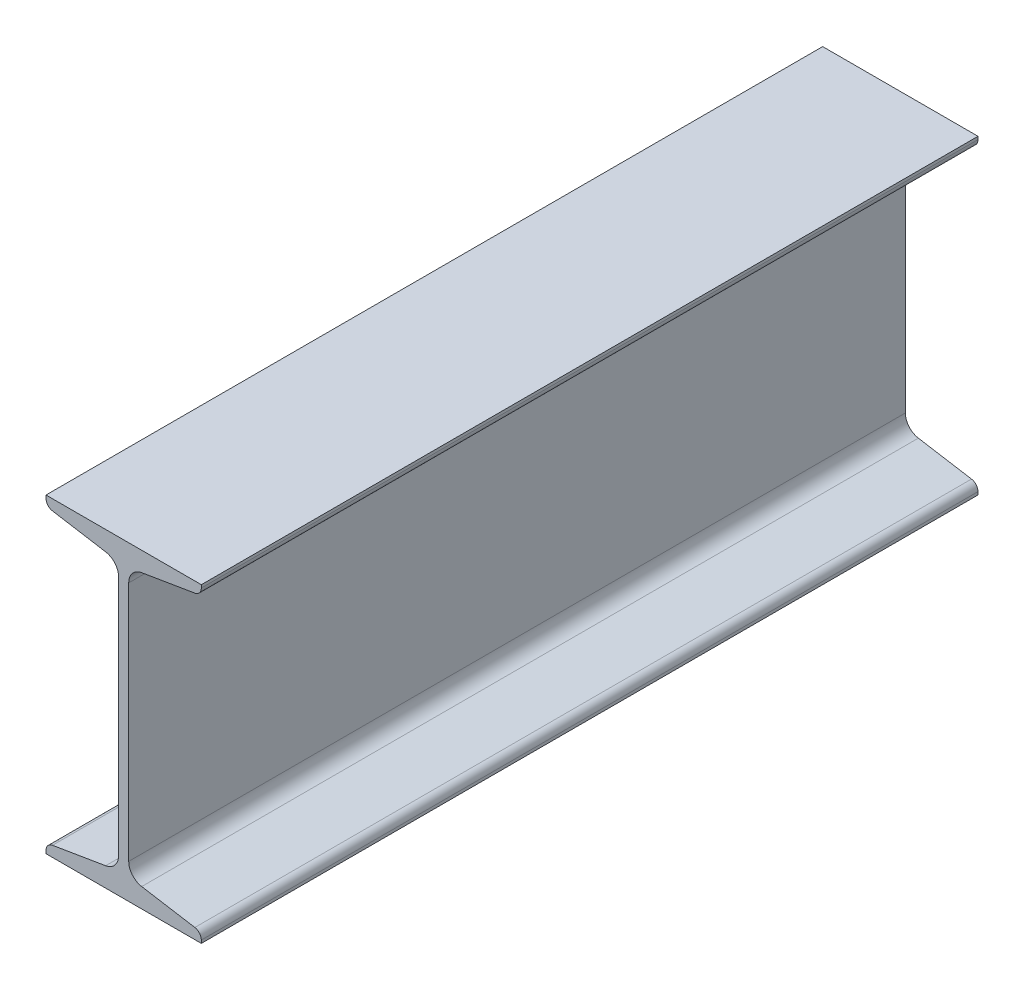
ISO-10303-21;
HEADER;
FILE_DESCRIPTION(('STEP AP214'),'2;1');
FILE_NAME('part.step','',(''),(''),'','','');
FILE_SCHEMA(('AUTOMOTIVE_DESIGN { 1 0 10303 214 1 1 1 1 }'));
ENDSEC;
DATA;
#1=APPLICATION_CONTEXT('core data for automotive mechanical design processes');
#2=APPLICATION_PROTOCOL_DEFINITION('international standard','automotive_design',2000,#1);
#3=PRODUCT_CONTEXT('',#1,'mechanical');
#4=PRODUCT('Part','Part','',(#3));
#5=PRODUCT_RELATED_PRODUCT_CATEGORY('part','',(#4));
#6=PRODUCT_DEFINITION_FORMATION('','',#4);
#7=PRODUCT_DEFINITION_CONTEXT('part definition',#1,'design');
#8=PRODUCT_DEFINITION('design','',#6,#7);
#9=PRODUCT_DEFINITION_SHAPE('','',#8);
#10=(LENGTH_UNIT() NAMED_UNIT(*) SI_UNIT(.MILLI.,.METRE.));
#11=(NAMED_UNIT(*) PLANE_ANGLE_UNIT() SI_UNIT($,.RADIAN.));
#12=(NAMED_UNIT(*) SI_UNIT($,.STERADIAN.) SOLID_ANGLE_UNIT());
#13=UNCERTAINTY_MEASURE_WITH_UNIT(LENGTH_MEASURE(1.E-05),#10,'distance_accuracy_value','');
#14=(GEOMETRIC_REPRESENTATION_CONTEXT(3) GLOBAL_UNCERTAINTY_ASSIGNED_CONTEXT((#13)) GLOBAL_UNIT_ASSIGNED_CONTEXT((#10,
#11,#12)) REPRESENTATION_CONTEXT('',''));
#15=CARTESIAN_POINT('',(0.,0.,0.));
#16=DIRECTION('',(0.,0.,1.));
#17=DIRECTION('',(1.,0.,0.));
#18=AXIS2_PLACEMENT_3D('',#15,#16,#17);
#19=CARTESIAN_POINT('',(120.,-4.44339418899995E-13,300.));
#20=DIRECTION('',(0.,-1.,0.));
#21=DIRECTION('',(1.,0.,0.));
#22=AXIS2_PLACEMENT_3D('',#19,#20,#21);
#23=PLANE('',#22);
#24=DIRECTION('',(-1.,0.,0.));
#25=VECTOR('',#24,1.);
#26=CARTESIAN_POINT('',(120.,-4.44339418899995E-13,-300.));
#27=LINE('',#26,#25);
#28=CARTESIAN_POINT('',(120.,-4.44339418899995E-13,-300.));
#29=VERTEX_POINT('',#28);
#30=CARTESIAN_POINT('',(0.,0.,-300.));
#31=VERTEX_POINT('',#30);
#32=EDGE_CURVE('E233',#29,#31,#27,.T.);
#33=ORIENTED_EDGE('',*,*,#32,.F.);
#34=DIRECTION('',(0.,0.,-1.));
#35=VECTOR('',#34,1.);
#36=CARTESIAN_POINT('',(120.,-4.44339418899995E-13,300.));
#37=LINE('',#36,#35);
#38=CARTESIAN_POINT('',(120.,-4.44339418899995E-13,300.));
#39=VERTEX_POINT('',#38);
#40=EDGE_CURVE('E191',#39,#29,#37,.T.);
#41=ORIENTED_EDGE('',*,*,#40,.F.);
#42=DIRECTION('',(-1.,0.,0.));
#43=VECTOR('',#42,1.);
#44=CARTESIAN_POINT('',(120.,-4.44339418899995E-13,300.));
#45=LINE('',#44,#43);
#46=CARTESIAN_POINT('',(0.,0.,300.));
#47=VERTEX_POINT('',#46);
#48=EDGE_CURVE('E186',#39,#47,#45,.T.);
#49=ORIENTED_EDGE('',*,*,#48,.T.);
#50=DIRECTION('',(0.,0.,-1.));
#51=VECTOR('',#50,1.);
#52=CARTESIAN_POINT('',(0.,0.,300.));
#53=LINE('',#52,#51);
#54=EDGE_CURVE('E169',#47,#31,#53,.T.);
#55=ORIENTED_EDGE('',*,*,#54,.T.);
#56=EDGE_LOOP('',(#33,#41,#49,#55));
#57=FACE_BOUND('',#56,.T.);
#58=ADVANCED_FACE('F32',(#57),#23,.T.);
#59=CARTESIAN_POINT('',(120.,7.32465895539263,300.));
#60=DIRECTION('',(1.,0.,0.));
#61=DIRECTION('',(0.,0.,-1.));
#62=AXIS2_PLACEMENT_3D('',#59,#60,#61);
#63=PLANE('',#62);
#64=DIRECTION('',(0.,-1.,0.));
#65=VECTOR('',#64,1.);
#66=CARTESIAN_POINT('',(120.,7.32465895539263,-300.));
#67=LINE('',#66,#65);
#68=CARTESIAN_POINT('',(120.,2.24195738173786,-300.));
#69=VERTEX_POINT('',#68);
#70=EDGE_CURVE('E192',#69,#29,#67,.T.);
#71=ORIENTED_EDGE('',*,*,#70,.F.);
#72=DIRECTION('',(0.,0.,-1.));
#73=VECTOR('',#72,1.);
#74=CARTESIAN_POINT('',(120.,2.24195738173786,300.));
#75=LINE('',#74,#73);
#76=CARTESIAN_POINT('',(120.,2.24195738173786,300.));
#77=VERTEX_POINT('',#76);
#78=EDGE_CURVE('E305',#69,#77,#75,.F.);
#79=ORIENTED_EDGE('',*,*,#78,.T.);
#80=DIRECTION('',(0.,-1.,0.));
#81=VECTOR('',#80,1.);
#82=CARTESIAN_POINT('',(120.,7.32465895539263,300.));
#83=LINE('',#82,#81);
#84=EDGE_CURVE('E181',#77,#39,#83,.T.);
#85=ORIENTED_EDGE('',*,*,#84,.T.);
#86=ORIENTED_EDGE('',*,*,#40,.T.);
#87=EDGE_LOOP('',(#71,#79,#85,#86));
#88=FACE_BOUND('',#87,.T.);
#89=ADVANCED_FACE('F382',(#88),#63,.T.);
#90=CARTESIAN_POINT('',(73.9270721275245,15.0040404372586,300.));
#91=DIRECTION('',(0.164410656039623,0.986391978972163,0.));
#92=DIRECTION('',(-0.986391978972163,0.164410656039623,0.));
#93=AXIS2_PLACEMENT_3D('',#90,#91,#92);
#94=PLANE('',#93);
#95=DIRECTION('',(0.986391978972163,-0.164410656039623,0.));
#96=VECTOR('',#95,1.);
#97=CARTESIAN_POINT('',(73.9270721275245,15.0040404372586,300.));
#98=LINE('',#97,#96);
#99=CARTESIAN_POINT('',(73.9270721275245,15.0040404372586,300.));
#100=VERTEX_POINT('',#99);
#101=CARTESIAN_POINT('',(114.986463936238,8.16030925557084,300.));
#102=VERTEX_POINT('',#101);
#103=EDGE_CURVE('E229',#100,#102,#98,.T.);
#104=ORIENTED_EDGE('',*,*,#103,.T.);
#105=DIRECTION('',(0.,0.,-1.));
#106=VECTOR('',#105,1.);
#107=CARTESIAN_POINT('',(114.986463936238,8.16030925557084,300.));
#108=LINE('',#107,#106);
#109=CARTESIAN_POINT('',(114.986463936238,8.16030925557084,-300.));
#110=VERTEX_POINT('',#109);
#111=EDGE_CURVE('E272',#102,#110,#108,.T.);
#112=ORIENTED_EDGE('',*,*,#111,.T.);
#113=DIRECTION('',(0.986391978972163,-0.164410656039623,0.));
#114=VECTOR('',#113,1.);
#115=CARTESIAN_POINT('',(73.9270721275245,15.0040404372586,-300.));
#116=LINE('',#115,#114);
#117=CARTESIAN_POINT('',(73.9270721275245,15.0040404372586,-300.));
#118=VERTEX_POINT('',#117);
#119=EDGE_CURVE('E194',#118,#110,#116,.T.);
#120=ORIENTED_EDGE('',*,*,#119,.F.);
#121=DIRECTION('',(0.,0.,-1.));
#122=VECTOR('',#121,1.);
#123=CARTESIAN_POINT('',(73.9270721275245,15.0040404372586,300.));
#124=LINE('',#123,#122);
#125=EDGE_CURVE('E273',#100,#118,#124,.T.);
#126=ORIENTED_EDGE('',*,*,#125,.F.);
#127=EDGE_LOOP('',(#104,#112,#120,#126));
#128=FACE_BOUND('',#127,.T.);
#129=ADVANCED_FACE('F376',(#128),#94,.T.);
#130=CARTESIAN_POINT('',(75.9,26.8407441849245,300.));
#131=DIRECTION('',(0.,0.,-1.));
#132=DIRECTION('',(-1.,0.,0.));
#133=AXIS2_PLACEMENT_3D('',#130,#131,#132);
#134=CYLINDRICAL_SURFACE('',#133,12.);
#135=CARTESIAN_POINT('',(75.9,26.8407441849245,-300.));
#136=DIRECTION('',(0.,0.,1.));
#137=DIRECTION('',(1.,0.,0.));
#138=AXIS2_PLACEMENT_3D('',#135,#136,#137);
#139=CIRCLE('',#138,12.);
#140=CARTESIAN_POINT('',(63.9,26.8407441849245,-300.));
#141=VERTEX_POINT('',#140);
#142=EDGE_CURVE('E266',#141,#118,#139,.T.);
#143=ORIENTED_EDGE('',*,*,#142,.F.);
#144=DIRECTION('',(0.,0.,-1.));
#145=VECTOR('',#144,1.);
#146=CARTESIAN_POINT('',(63.9,26.8407441849245,300.));
#147=LINE('',#146,#145);
#148=CARTESIAN_POINT('',(63.9,26.8407441849245,300.));
#149=VERTEX_POINT('',#148);
#150=EDGE_CURVE('E275',#149,#141,#147,.T.);
#151=ORIENTED_EDGE('',*,*,#150,.F.);
#152=CARTESIAN_POINT('',(75.9,26.8407441849245,300.));
#153=DIRECTION('',(0.,0.,1.));
#154=DIRECTION('',(1.,0.,0.));
#155=AXIS2_PLACEMENT_3D('',#152,#153,#154);
#156=CIRCLE('',#155,12.);
#157=EDGE_CURVE('E226',#149,#100,#156,.T.);
#158=ORIENTED_EDGE('',*,*,#157,.T.);
#159=ORIENTED_EDGE('',*,*,#125,.T.);
#160=EDGE_LOOP('',(#143,#151,#158,#159));
#161=FACE_BOUND('',#160,.T.);
#162=ADVANCED_FACE('F372',(#161),#134,.F.);
#163=CARTESIAN_POINT('',(63.9,213.159255815075,300.));
#164=DIRECTION('',(1.,0.,0.));
#165=DIRECTION('',(0.,1.,0.));
#166=AXIS2_PLACEMENT_3D('',#163,#164,#165);
#167=PLANE('',#166);
#168=DIRECTION('',(0.,-1.,0.));
#169=VECTOR('',#168,1.);
#170=CARTESIAN_POINT('',(63.9,213.159255815075,-300.));
#171=LINE('',#170,#169);
#172=CARTESIAN_POINT('',(63.9,213.159255815075,-300.));
#173=VERTEX_POINT('',#172);
#174=EDGE_CURVE('E263',#173,#141,#171,.T.);
#175=ORIENTED_EDGE('',*,*,#174,.F.);
#176=DIRECTION('',(0.,0.,-1.));
#177=VECTOR('',#176,1.);
#178=CARTESIAN_POINT('',(63.9,213.159255815075,300.));
#179=LINE('',#178,#177);
#180=CARTESIAN_POINT('',(63.9,213.159255815075,300.));
#181=VERTEX_POINT('',#180);
#182=EDGE_CURVE('E277',#181,#173,#179,.T.);
#183=ORIENTED_EDGE('',*,*,#182,.F.);
#184=DIRECTION('',(0.,-1.,0.));
#185=VECTOR('',#184,1.);
#186=CARTESIAN_POINT('',(63.9,213.159255815075,300.));
#187=LINE('',#186,#185);
#188=EDGE_CURVE('E223',#181,#149,#187,.T.);
#189=ORIENTED_EDGE('',*,*,#188,.T.);
#190=ORIENTED_EDGE('',*,*,#150,.T.);
#191=EDGE_LOOP('',(#175,#183,#189,#190));
#192=FACE_BOUND('',#191,.T.);
#193=ADVANCED_FACE('F368',(#192),#167,.T.);
#194=CARTESIAN_POINT('',(75.8999999999999,213.159255815075,300.));
#195=DIRECTION('',(0.,0.,-1.));
#196=DIRECTION('',(-1.,0.,0.));
#197=AXIS2_PLACEMENT_3D('',#194,#195,#196);
#198=CYLINDRICAL_SURFACE('',#197,12.);
#199=CARTESIAN_POINT('',(75.8999999999999,213.159255815075,-300.));
#200=DIRECTION('',(0.,0.,1.));
#201=DIRECTION('',(1.,0.,0.));
#202=AXIS2_PLACEMENT_3D('',#199,#200,#201);
#203=CIRCLE('',#202,12.);
#204=CARTESIAN_POINT('',(73.9270721275245,224.995959562741,-300.));
#205=VERTEX_POINT('',#204);
#206=EDGE_CURVE('E260',#205,#173,#203,.T.);
#207=ORIENTED_EDGE('',*,*,#206,.F.);
#208=DIRECTION('',(0.,0.,-1.));
#209=VECTOR('',#208,1.);
#210=CARTESIAN_POINT('',(73.9270721275245,224.995959562741,300.));
#211=LINE('',#210,#209);
#212=CARTESIAN_POINT('',(73.9270721275245,224.995959562741,300.));
#213=VERTEX_POINT('',#212);
#214=EDGE_CURVE('E279',#213,#205,#211,.T.);
#215=ORIENTED_EDGE('',*,*,#214,.F.);
#216=CARTESIAN_POINT('',(75.8999999999999,213.159255815075,300.));
#217=DIRECTION('',(0.,0.,1.));
#218=DIRECTION('',(1.,0.,0.));
#219=AXIS2_PLACEMENT_3D('',#216,#217,#218);
#220=CIRCLE('',#219,12.);
#221=EDGE_CURVE('E220',#213,#181,#220,.T.);
#222=ORIENTED_EDGE('',*,*,#221,.T.);
#223=ORIENTED_EDGE('',*,*,#182,.T.);
#224=EDGE_LOOP('',(#207,#215,#222,#223));
#225=FACE_BOUND('',#224,.T.);
#226=ADVANCED_FACE('F364',(#225),#198,.F.);
#227=CARTESIAN_POINT('',(120.,232.675341044606,300.));
#228=DIRECTION('',(0.164410656039623,-0.986391978972163,0.));
#229=DIRECTION('',(0.986391978972163,0.164410656039623,0.));
#230=AXIS2_PLACEMENT_3D('',#227,#228,#229);
#231=PLANE('',#230);
#232=DIRECTION('',(-0.986391978972164,-0.164410656039623,0.));
#233=VECTOR('',#232,1.);
#234=CARTESIAN_POINT('',(120.,232.675341044606,-300.));
#235=LINE('',#234,#233);
#236=CARTESIAN_POINT('',(114.986463936238,231.839690744428,-300.));
#237=VERTEX_POINT('',#236);
#238=EDGE_CURVE('E258',#237,#205,#235,.T.);
#239=ORIENTED_EDGE('',*,*,#238,.F.);
#240=DIRECTION('',(0.,0.,-1.));
#241=VECTOR('',#240,1.);
#242=CARTESIAN_POINT('',(114.986463936238,231.839690744428,300.));
#243=LINE('',#242,#241);
#244=CARTESIAN_POINT('',(114.986463936238,231.839690744428,300.));
#245=VERTEX_POINT('',#244);
#246=EDGE_CURVE('E320',#237,#245,#243,.F.);
#247=ORIENTED_EDGE('',*,*,#246,.T.);
#248=DIRECTION('',(-0.986391978972164,-0.164410656039623,0.));
#249=VECTOR('',#248,1.);
#250=CARTESIAN_POINT('',(120.,232.675341044606,300.));
#251=LINE('',#250,#249);
#252=EDGE_CURVE('E218',#245,#213,#251,.T.);
#253=ORIENTED_EDGE('',*,*,#252,.T.);
#254=ORIENTED_EDGE('',*,*,#214,.T.);
#255=EDGE_LOOP('',(#239,#247,#253,#254));
#256=FACE_BOUND('',#255,.T.);
#257=ADVANCED_FACE('F358',(#256),#231,.T.);
#258=CARTESIAN_POINT('',(120.,240.,300.));
#259=DIRECTION('',(1.,0.,0.));
#260=DIRECTION('',(0.,1.,0.));
#261=AXIS2_PLACEMENT_3D('',#258,#259,#260);
#262=PLANE('',#261);
#263=DIRECTION('',(0.,-1.,0.));
#264=VECTOR('',#263,1.);
#265=CARTESIAN_POINT('',(120.,240.,300.));
#266=LINE('',#265,#264);
#267=CARTESIAN_POINT('',(120.,240.,300.));
#268=VERTEX_POINT('',#267);
#269=CARTESIAN_POINT('',(120.,237.758042618261,300.));
#270=VERTEX_POINT('',#269);
#271=EDGE_CURVE('E215',#268,#270,#266,.T.);
#272=ORIENTED_EDGE('',*,*,#271,.T.);
#273=DIRECTION('',(0.,0.,-1.));
#274=VECTOR('',#273,1.);
#275=CARTESIAN_POINT('',(120.,237.758042618261,300.));
#276=LINE('',#275,#274);
#277=CARTESIAN_POINT('',(120.,237.758042618261,-300.));
#278=VERTEX_POINT('',#277);
#279=EDGE_CURVE('E317',#270,#278,#276,.T.);
#280=ORIENTED_EDGE('',*,*,#279,.T.);
#281=DIRECTION('',(0.,-1.,0.));
#282=VECTOR('',#281,1.);
#283=CARTESIAN_POINT('',(120.,240.,-300.));
#284=LINE('',#283,#282);
#285=CARTESIAN_POINT('',(120.,240.,-300.));
#286=VERTEX_POINT('',#285);
#287=EDGE_CURVE('E255',#286,#278,#284,.T.);
#288=ORIENTED_EDGE('',*,*,#287,.F.);
#289=DIRECTION('',(0.,0.,-1.));
#290=VECTOR('',#289,1.);
#291=CARTESIAN_POINT('',(120.,240.,300.));
#292=LINE('',#291,#290);
#293=EDGE_CURVE('E282',#268,#286,#292,.T.);
#294=ORIENTED_EDGE('',*,*,#293,.F.);
#295=EDGE_LOOP('',(#272,#280,#288,#294));
#296=FACE_BOUND('',#295,.T.);
#297=ADVANCED_FACE('F350',(#296),#262,.T.);
#298=CARTESIAN_POINT('',(0.,240.,300.));
#299=DIRECTION('',(0.,1.,0.));
#300=DIRECTION('',(0.,0.,1.));
#301=AXIS2_PLACEMENT_3D('',#298,#299,#300);
#302=PLANE('',#301);
#303=DIRECTION('',(1.,0.,0.));
#304=VECTOR('',#303,1.);
#305=CARTESIAN_POINT('',(0.,240.,-300.));
#306=LINE('',#305,#304);
#307=CARTESIAN_POINT('',(0.,240.,-300.));
#308=VERTEX_POINT('',#307);
#309=EDGE_CURVE('E252',#308,#286,#306,.T.);
#310=ORIENTED_EDGE('',*,*,#309,.F.);
#311=DIRECTION('',(0.,0.,-1.));
#312=VECTOR('',#311,1.);
#313=CARTESIAN_POINT('',(0.,240.,300.));
#314=LINE('',#313,#312);
#315=CARTESIAN_POINT('',(0.,240.,300.));
#316=VERTEX_POINT('',#315);
#317=EDGE_CURVE('E284',#316,#308,#314,.T.);
#318=ORIENTED_EDGE('',*,*,#317,.F.);
#319=DIRECTION('',(1.,0.,0.));
#320=VECTOR('',#319,1.);
#321=CARTESIAN_POINT('',(0.,240.,300.));
#322=LINE('',#321,#320);
#323=EDGE_CURVE('E212',#316,#268,#322,.T.);
#324=ORIENTED_EDGE('',*,*,#323,.T.);
#325=ORIENTED_EDGE('',*,*,#293,.T.);
#326=EDGE_LOOP('',(#310,#318,#324,#325));
#327=FACE_BOUND('',#326,.T.);
#328=ADVANCED_FACE('F347',(#327),#302,.T.);
#329=CARTESIAN_POINT('',(0.,232.675341044606,300.));
#330=DIRECTION('',(-1.,0.,0.));
#331=DIRECTION('',(0.,-1.,0.));
#332=AXIS2_PLACEMENT_3D('',#329,#330,#331);
#333=PLANE('',#332);
#334=DIRECTION('',(0.,1.,0.));
#335=VECTOR('',#334,1.);
#336=CARTESIAN_POINT('',(0.,232.675341044606,-300.));
#337=LINE('',#336,#335);
#338=CARTESIAN_POINT('',(0.,237.758042618261,-300.));
#339=VERTEX_POINT('',#338);
#340=EDGE_CURVE('E250',#339,#308,#337,.T.);
#341=ORIENTED_EDGE('',*,*,#340,.F.);
#342=DIRECTION('',(0.,0.,-1.));
#343=VECTOR('',#342,1.);
#344=CARTESIAN_POINT('',(0.,237.758042618261,300.));
#345=LINE('',#344,#343);
#346=CARTESIAN_POINT('',(0.,237.758042618261,300.));
#347=VERTEX_POINT('',#346);
#348=EDGE_CURVE('E11',#339,#347,#345,.F.);
#349=ORIENTED_EDGE('',*,*,#348,.T.);
#350=DIRECTION('',(0.,1.,0.));
#351=VECTOR('',#350,1.);
#352=CARTESIAN_POINT('',(0.,232.675341044606,300.));
#353=LINE('',#352,#351);
#354=EDGE_CURVE('E210',#347,#316,#353,.T.);
#355=ORIENTED_EDGE('',*,*,#354,.T.);
#356=ORIENTED_EDGE('',*,*,#317,.T.);
#357=EDGE_LOOP('',(#341,#349,#355,#356));
#358=FACE_BOUND('',#357,.T.);
#359=ADVANCED_FACE('F342',(#358),#333,.T.);
#360=CARTESIAN_POINT('',(46.0729278724754,224.99595956274,300.));
#361=DIRECTION('',(-0.164410656039624,-0.986391978972163,0.));
#362=DIRECTION('',(0.986391978972163,-0.164410656039624,0.));
#363=AXIS2_PLACEMENT_3D('',#360,#361,#362);
#364=PLANE('',#363);
#365=DIRECTION('',(-0.986391978972163,0.164410656039624,0.));
#366=VECTOR('',#365,1.);
#367=CARTESIAN_POINT('',(46.0729278724754,224.99595956274,300.));
#368=LINE('',#367,#366);
#369=CARTESIAN_POINT('',(46.0729278724754,224.99595956274,300.));
#370=VERTEX_POINT('',#369);
#371=CARTESIAN_POINT('',(5.01353606376221,231.839690744428,300.));
#372=VERTEX_POINT('',#371);
#373=EDGE_CURVE('E207',#370,#372,#368,.T.);
#374=ORIENTED_EDGE('',*,*,#373,.T.);
#375=DIRECTION('',(0.,0.,-1.));
#376=VECTOR('',#375,1.);
#377=CARTESIAN_POINT('',(5.01353606376221,231.839690744428,300.));
#378=LINE('',#377,#376);
#379=CARTESIAN_POINT('',(5.01353606376221,231.839690744428,-300.));
#380=VERTEX_POINT('',#379);
#381=EDGE_CURVE('E40',#372,#380,#378,.T.);
#382=ORIENTED_EDGE('',*,*,#381,.T.);
#383=DIRECTION('',(-0.986391978972163,0.164410656039624,0.));
#384=VECTOR('',#383,1.);
#385=CARTESIAN_POINT('',(46.0729278724754,224.99595956274,-300.));
#386=LINE('',#385,#384);
#387=CARTESIAN_POINT('',(46.0729278724754,224.99595956274,-300.));
#388=VERTEX_POINT('',#387);
#389=EDGE_CURVE('E247',#388,#380,#386,.T.);
#390=ORIENTED_EDGE('',*,*,#389,.F.);
#391=DIRECTION('',(0.,0.,-1.));
#392=VECTOR('',#391,1.);
#393=CARTESIAN_POINT('',(46.0729278724754,224.99595956274,300.));
#394=LINE('',#393,#392);
#395=EDGE_CURVE('E287',#370,#388,#394,.T.);
#396=ORIENTED_EDGE('',*,*,#395,.F.);
#397=EDGE_LOOP('',(#374,#382,#390,#396));
#398=FACE_BOUND('',#397,.T.);
#399=ADVANCED_FACE('F325',(#398),#364,.T.);
#400=CARTESIAN_POINT('',(44.1,213.159255815075,300.));
#401=DIRECTION('',(0.,0.,-1.));
#402=DIRECTION('',(-1.,0.,0.));
#403=AXIS2_PLACEMENT_3D('',#400,#401,#402);
#404=CYLINDRICAL_SURFACE('',#403,12.);
#405=CARTESIAN_POINT('',(44.1,213.159255815075,-300.));
#406=DIRECTION('',(0.,0.,1.));
#407=DIRECTION('',(1.,0.,0.));
#408=AXIS2_PLACEMENT_3D('',#405,#406,#407);
#409=CIRCLE('',#408,12.);
#410=CARTESIAN_POINT('',(56.1,213.159255815074,-300.));
#411=VERTEX_POINT('',#410);
#412=EDGE_CURVE('E244',#411,#388,#409,.T.);
#413=ORIENTED_EDGE('',*,*,#412,.F.);
#414=DIRECTION('',(0.,0.,-1.));
#415=VECTOR('',#414,1.);
#416=CARTESIAN_POINT('',(56.1,213.159255815074,300.));
#417=LINE('',#416,#415);
#418=CARTESIAN_POINT('',(56.1,213.159255815074,300.));
#419=VERTEX_POINT('',#418);
#420=EDGE_CURVE('E289',#419,#411,#417,.T.);
#421=ORIENTED_EDGE('',*,*,#420,.F.);
#422=CARTESIAN_POINT('',(44.1,213.159255815075,300.));
#423=DIRECTION('',(0.,0.,1.));
#424=DIRECTION('',(1.,0.,0.));
#425=AXIS2_PLACEMENT_3D('',#422,#423,#424);
#426=CIRCLE('',#425,12.);
#427=EDGE_CURVE('E204',#419,#370,#426,.T.);
#428=ORIENTED_EDGE('',*,*,#427,.T.);
#429=ORIENTED_EDGE('',*,*,#395,.T.);
#430=EDGE_LOOP('',(#413,#421,#428,#429));
#431=FACE_BOUND('',#430,.T.);
#432=ADVANCED_FACE('F335',(#431),#404,.F.);
#433=CARTESIAN_POINT('',(56.1,26.8407441849245,300.));
#434=DIRECTION('',(-1.,0.,0.));
#435=DIRECTION('',(0.,-1.,0.));
#436=AXIS2_PLACEMENT_3D('',#433,#434,#435);
#437=PLANE('',#436);
#438=DIRECTION('',(0.,1.,0.));
#439=VECTOR('',#438,1.);
#440=CARTESIAN_POINT('',(56.1,26.8407441849245,-300.));
#441=LINE('',#440,#439);
#442=CARTESIAN_POINT('',(56.1,26.8407441849245,-300.));
#443=VERTEX_POINT('',#442);
#444=EDGE_CURVE('E241',#443,#411,#441,.T.);
#445=ORIENTED_EDGE('',*,*,#444,.F.);
#446=DIRECTION('',(0.,0.,-1.));
#447=VECTOR('',#446,1.);
#448=CARTESIAN_POINT('',(56.1,26.8407441849245,300.));
#449=LINE('',#448,#447);
#450=CARTESIAN_POINT('',(56.1,26.8407441849245,300.));
#451=VERTEX_POINT('',#450);
#452=EDGE_CURVE('E291',#451,#443,#449,.T.);
#453=ORIENTED_EDGE('',*,*,#452,.F.);
#454=DIRECTION('',(0.,1.,0.));
#455=VECTOR('',#454,1.);
#456=CARTESIAN_POINT('',(56.1,26.8407441849245,300.));
#457=LINE('',#456,#455);
#458=EDGE_CURVE('E201',#451,#419,#457,.T.);
#459=ORIENTED_EDGE('',*,*,#458,.T.);
#460=ORIENTED_EDGE('',*,*,#420,.T.);
#461=EDGE_LOOP('',(#445,#453,#459,#460));
#462=FACE_BOUND('',#461,.T.);
#463=ADVANCED_FACE('F410',(#462),#437,.T.);
#464=CARTESIAN_POINT('',(44.1,26.8407441849245,300.));
#465=DIRECTION('',(0.,0.,-1.));
#466=DIRECTION('',(-1.,0.,0.));
#467=AXIS2_PLACEMENT_3D('',#464,#465,#466);
#468=CYLINDRICAL_SURFACE('',#467,12.);
#469=CARTESIAN_POINT('',(44.1,26.8407441849245,-300.));
#470=DIRECTION('',(0.,0.,1.));
#471=DIRECTION('',(1.,0.,0.));
#472=AXIS2_PLACEMENT_3D('',#469,#470,#471);
#473=CIRCLE('',#472,12.);
#474=CARTESIAN_POINT('',(46.0729278724755,15.0040404372586,-300.));
#475=VERTEX_POINT('',#474);
#476=EDGE_CURVE('E238',#475,#443,#473,.T.);
#477=ORIENTED_EDGE('',*,*,#476,.F.);
#478=DIRECTION('',(0.,0.,-1.));
#479=VECTOR('',#478,1.);
#480=CARTESIAN_POINT('',(46.0729278724755,15.0040404372586,300.));
#481=LINE('',#480,#479);
#482=CARTESIAN_POINT('',(46.0729278724755,15.0040404372586,300.));
#483=VERTEX_POINT('',#482);
#484=EDGE_CURVE('E180',#483,#475,#481,.T.);
#485=ORIENTED_EDGE('',*,*,#484,.F.);
#486=CARTESIAN_POINT('',(44.1,26.8407441849245,300.));
#487=DIRECTION('',(0.,0.,1.));
#488=DIRECTION('',(1.,0.,0.));
#489=AXIS2_PLACEMENT_3D('',#486,#487,#488);
#490=CIRCLE('',#489,12.);
#491=EDGE_CURVE('E198',#483,#451,#490,.T.);
#492=ORIENTED_EDGE('',*,*,#491,.T.);
#493=ORIENTED_EDGE('',*,*,#452,.T.);
#494=EDGE_LOOP('',(#477,#485,#492,#493));
#495=FACE_BOUND('',#494,.T.);
#496=ADVANCED_FACE('F407',(#495),#468,.F.);
#497=CARTESIAN_POINT('',(0.,7.32465895539261,300.));
#498=DIRECTION('',(-0.164410656039623,0.986391978972163,0.));
#499=DIRECTION('',(-0.986391978972163,-0.164410656039623,0.));
#500=AXIS2_PLACEMENT_3D('',#497,#498,#499);
#501=PLANE('',#500);
#502=DIRECTION('',(0.986391978972163,0.164410656039623,0.));
#503=VECTOR('',#502,1.);
#504=CARTESIAN_POINT('',(0.,7.32465895539261,-300.));
#505=LINE('',#504,#503);
#506=CARTESIAN_POINT('',(5.01353606376226,8.16030925557082,-300.));
#507=VERTEX_POINT('',#506);
#508=EDGE_CURVE('E236',#507,#475,#505,.T.);
#509=ORIENTED_EDGE('',*,*,#508,.F.);
#510=DIRECTION('',(0.,0.,-1.));
#511=VECTOR('',#510,1.);
#512=CARTESIAN_POINT('',(5.01353606376226,8.16030925557082,300.));
#513=LINE('',#512,#511);
#514=CARTESIAN_POINT('',(5.01353606376226,8.16030925557082,300.));
#515=VERTEX_POINT('',#514);
#516=EDGE_CURVE('E55',#507,#515,#513,.F.);
#517=ORIENTED_EDGE('',*,*,#516,.T.);
#518=DIRECTION('',(0.986391978972163,0.164410656039623,0.));
#519=VECTOR('',#518,1.);
#520=CARTESIAN_POINT('',(0.,7.32465895539261,300.));
#521=LINE('',#520,#519);
#522=EDGE_CURVE('E187',#515,#483,#521,.T.);
#523=ORIENTED_EDGE('',*,*,#522,.T.);
#524=ORIENTED_EDGE('',*,*,#484,.T.);
#525=EDGE_LOOP('',(#509,#517,#523,#524));
#526=FACE_BOUND('',#525,.T.);
#527=ADVANCED_FACE('F404',(#526),#501,.T.);
#528=CARTESIAN_POINT('',(0.,0.,300.));
#529=DIRECTION('',(-1.,0.,0.));
#530=DIRECTION('',(0.,-1.,0.));
#531=AXIS2_PLACEMENT_3D('',#528,#529,#530);
#532=PLANE('',#531);
#533=DIRECTION('',(0.,1.,0.));
#534=VECTOR('',#533,1.);
#535=CARTESIAN_POINT('',(0.,0.,300.));
#536=LINE('',#535,#534);
#537=CARTESIAN_POINT('',(0.,2.24195738173783,300.));
#538=VERTEX_POINT('',#537);
#539=EDGE_CURVE('E172',#47,#538,#536,.T.);
#540=ORIENTED_EDGE('',*,*,#539,.T.);
#541=DIRECTION('',(0.,0.,-1.));
#542=VECTOR('',#541,1.);
#543=CARTESIAN_POINT('',(0.,2.24195738173783,300.));
#544=LINE('',#543,#542);
#545=CARTESIAN_POINT('',(0.,2.24195738173783,-300.));
#546=VERTEX_POINT('',#545);
#547=EDGE_CURVE('E314',#538,#546,#544,.T.);
#548=ORIENTED_EDGE('',*,*,#547,.T.);
#549=DIRECTION('',(0.,1.,0.));
#550=VECTOR('',#549,1.);
#551=CARTESIAN_POINT('',(0.,0.,-300.));
#552=LINE('',#551,#550);
#553=EDGE_CURVE('E175',#31,#546,#552,.T.);
#554=ORIENTED_EDGE('',*,*,#553,.F.);
#555=ORIENTED_EDGE('',*,*,#54,.F.);
#556=EDGE_LOOP('',(#540,#548,#554,#555));
#557=FACE_BOUND('',#556,.T.);
#558=ADVANCED_FACE('F170',(#557),#532,.T.);
#559=CARTESIAN_POINT('',(44.1,26.8407441849245,300.));
#560=DIRECTION('',(0.,0.,1.));
#561=DIRECTION('',(1.,0.,0.));
#562=AXIS2_PLACEMENT_3D('',#559,#560,#561);
#563=PLANE('',#562);
#564=ORIENTED_EDGE('',*,*,#84,.F.);
#565=CARTESIAN_POINT('',(114.,2.24195738173786,300.));
#566=DIRECTION('',(0.,0.,1.));
#567=DIRECTION('',(1.,0.,0.));
#568=AXIS2_PLACEMENT_3D('',#565,#566,#567);
#569=CIRCLE('',#568,6.);
#570=EDGE_CURVE('E312',#77,#102,#569,.T.);
#571=ORIENTED_EDGE('',*,*,#570,.T.);
#572=ORIENTED_EDGE('',*,*,#103,.F.);
#573=ORIENTED_EDGE('',*,*,#157,.F.);
#574=ORIENTED_EDGE('',*,*,#188,.F.);
#575=ORIENTED_EDGE('',*,*,#221,.F.);
#576=ORIENTED_EDGE('',*,*,#252,.F.);
#577=CARTESIAN_POINT('',(114.,237.758042618261,300.));
#578=DIRECTION('',(0.,0.,1.));
#579=DIRECTION('',(1.,0.,0.));
#580=AXIS2_PLACEMENT_3D('',#577,#578,#579);
#581=CIRCLE('',#580,6.);
#582=EDGE_CURVE('E309',#245,#270,#581,.T.);
#583=ORIENTED_EDGE('',*,*,#582,.T.);
#584=ORIENTED_EDGE('',*,*,#271,.F.);
#585=ORIENTED_EDGE('',*,*,#323,.F.);
#586=ORIENTED_EDGE('',*,*,#354,.F.);
#587=CARTESIAN_POINT('',(5.99999999999995,237.758042618261,300.));
#588=DIRECTION('',(0.,0.,1.));
#589=DIRECTION('',(1.,0.,0.));
#590=AXIS2_PLACEMENT_3D('',#587,#588,#589);
#591=CIRCLE('',#590,6.);
#592=EDGE_CURVE('E307',#347,#372,#591,.T.);
#593=ORIENTED_EDGE('',*,*,#592,.T.);
#594=ORIENTED_EDGE('',*,*,#373,.F.);
#595=ORIENTED_EDGE('',*,*,#427,.F.);
#596=ORIENTED_EDGE('',*,*,#458,.F.);
#597=ORIENTED_EDGE('',*,*,#491,.F.);
#598=ORIENTED_EDGE('',*,*,#522,.F.);
#599=CARTESIAN_POINT('',(6.,2.24195738173783,300.));
#600=DIRECTION('',(0.,0.,1.));
#601=DIRECTION('',(1.,0.,0.));
#602=AXIS2_PLACEMENT_3D('',#599,#600,#601);
#603=CIRCLE('',#602,6.);
#604=EDGE_CURVE('E47',#515,#538,#603,.T.);
#605=ORIENTED_EDGE('',*,*,#604,.T.);
#606=ORIENTED_EDGE('',*,*,#539,.F.);
#607=ORIENTED_EDGE('',*,*,#48,.F.);
#608=EDGE_LOOP('',(#564,#571,#572,#573,#574,#575,#576,#583,#584,#585,#586,#593,#594,#595,#596,
#597,#598,#605,#606,#607));
#609=FACE_BOUND('',#608,.T.);
#610=ADVANCED_FACE('F185',(#609),#563,.T.);
#611=CARTESIAN_POINT('',(44.1,26.8407441849245,-300.));
#612=DIRECTION('',(0.,0.,1.));
#613=DIRECTION('',(1.,0.,0.));
#614=AXIS2_PLACEMENT_3D('',#611,#612,#613);
#615=PLANE('',#614);
#616=ORIENTED_EDGE('',*,*,#119,.T.);
#617=CARTESIAN_POINT('',(114.,2.24195738173786,-300.));
#618=DIRECTION('',(0.,0.,1.));
#619=DIRECTION('',(1.,0.,0.));
#620=AXIS2_PLACEMENT_3D('',#617,#618,#619);
#621=CIRCLE('',#620,6.);
#622=EDGE_CURVE('E303',#110,#69,#621,.F.);
#623=ORIENTED_EDGE('',*,*,#622,.T.);
#624=ORIENTED_EDGE('',*,*,#70,.T.);
#625=ORIENTED_EDGE('',*,*,#32,.T.);
#626=ORIENTED_EDGE('',*,*,#553,.T.);
#627=CARTESIAN_POINT('',(6.,2.24195738173783,-300.));
#628=DIRECTION('',(0.,0.,1.));
#629=DIRECTION('',(1.,0.,0.));
#630=AXIS2_PLACEMENT_3D('',#627,#628,#629);
#631=CIRCLE('',#630,6.);
#632=EDGE_CURVE('E301',#546,#507,#631,.F.);
#633=ORIENTED_EDGE('',*,*,#632,.T.);
#634=ORIENTED_EDGE('',*,*,#508,.T.);
#635=ORIENTED_EDGE('',*,*,#476,.T.);
#636=ORIENTED_EDGE('',*,*,#444,.T.);
#637=ORIENTED_EDGE('',*,*,#412,.T.);
#638=ORIENTED_EDGE('',*,*,#389,.T.);
#639=CARTESIAN_POINT('',(5.99999999999995,237.758042618261,-300.));
#640=DIRECTION('',(0.,0.,1.));
#641=DIRECTION('',(1.,0.,0.));
#642=AXIS2_PLACEMENT_3D('',#639,#640,#641);
#643=CIRCLE('',#642,6.);
#644=EDGE_CURVE('E297',#380,#339,#643,.F.);
#645=ORIENTED_EDGE('',*,*,#644,.T.);
#646=ORIENTED_EDGE('',*,*,#340,.T.);
#647=ORIENTED_EDGE('',*,*,#309,.T.);
#648=ORIENTED_EDGE('',*,*,#287,.T.);
#649=CARTESIAN_POINT('',(114.,237.758042618261,-300.));
#650=DIRECTION('',(0.,0.,1.));
#651=DIRECTION('',(1.,0.,0.));
#652=AXIS2_PLACEMENT_3D('',#649,#650,#651);
#653=CIRCLE('',#652,6.);
#654=EDGE_CURVE('E299',#278,#237,#653,.F.);
#655=ORIENTED_EDGE('',*,*,#654,.T.);
#656=ORIENTED_EDGE('',*,*,#238,.T.);
#657=ORIENTED_EDGE('',*,*,#206,.T.);
#658=ORIENTED_EDGE('',*,*,#174,.T.);
#659=ORIENTED_EDGE('',*,*,#142,.T.);
#660=EDGE_LOOP('',(#616,#623,#624,#625,#626,#633,#634,#635,#636,#637,#638,#645,#646,#647,#648,
#655,#656,#657,#658,#659));
#661=FACE_BOUND('',#660,.T.);
#662=ADVANCED_FACE('F330',(#661),#615,.F.);
#663=CARTESIAN_POINT('',(114.,2.24195738173786,300.));
#664=DIRECTION('',(0.,0.,-1.));
#665=DIRECTION('',(-1.,0.,0.));
#666=AXIS2_PLACEMENT_3D('',#663,#664,#665);
#667=CYLINDRICAL_SURFACE('',#666,6.);
#668=ORIENTED_EDGE('',*,*,#570,.F.);
#669=ORIENTED_EDGE('',*,*,#78,.F.);
#670=ORIENTED_EDGE('',*,*,#622,.F.);
#671=ORIENTED_EDGE('',*,*,#111,.F.);
#672=EDGE_LOOP('',(#668,#669,#670,#671));
#673=FACE_BOUND('',#672,.T.);
#674=ADVANCED_FACE('F384',(#673),#667,.T.);
#675=CARTESIAN_POINT('',(6.,2.24195738173783,300.));
#676=DIRECTION('',(0.,0.,-1.));
#677=DIRECTION('',(-1.,0.,0.));
#678=AXIS2_PLACEMENT_3D('',#675,#676,#677);
#679=CYLINDRICAL_SURFACE('',#678,6.);
#680=ORIENTED_EDGE('',*,*,#604,.F.);
#681=ORIENTED_EDGE('',*,*,#516,.F.);
#682=ORIENTED_EDGE('',*,*,#632,.F.);
#683=ORIENTED_EDGE('',*,*,#547,.F.);
#684=EDGE_LOOP('',(#680,#681,#682,#683));
#685=FACE_BOUND('',#684,.T.);
#686=ADVANCED_FACE('F386',(#685),#679,.T.);
#687=CARTESIAN_POINT('',(114.,237.758042618261,300.));
#688=DIRECTION('',(0.,0.,-1.));
#689=DIRECTION('',(-1.,0.,0.));
#690=AXIS2_PLACEMENT_3D('',#687,#688,#689);
#691=CYLINDRICAL_SURFACE('',#690,6.);
#692=ORIENTED_EDGE('',*,*,#582,.F.);
#693=ORIENTED_EDGE('',*,*,#246,.F.);
#694=ORIENTED_EDGE('',*,*,#654,.F.);
#695=ORIENTED_EDGE('',*,*,#279,.F.);
#696=EDGE_LOOP('',(#692,#693,#694,#695));
#697=FACE_BOUND('',#696,.T.);
#698=ADVANCED_FACE('F354',(#697),#691,.T.);
#699=CARTESIAN_POINT('',(5.99999999999995,237.758042618261,300.));
#700=DIRECTION('',(0.,0.,-1.));
#701=DIRECTION('',(-1.,0.,0.));
#702=AXIS2_PLACEMENT_3D('',#699,#700,#701);
#703=CYLINDRICAL_SURFACE('',#702,6.);
#704=ORIENTED_EDGE('',*,*,#592,.F.);
#705=ORIENTED_EDGE('',*,*,#348,.F.);
#706=ORIENTED_EDGE('',*,*,#644,.F.);
#707=ORIENTED_EDGE('',*,*,#381,.F.);
#708=EDGE_LOOP('',(#704,#705,#706,#707));
#709=FACE_BOUND('',#708,.T.);
#710=ADVANCED_FACE('F34',(#709),#703,.T.);
#711=CLOSED_SHELL('',(#58,#89,#129,#162,#193,#226,#257,#297,#328,#359,#399,#432,#463,#496,#527,
#558,#610,#662,#674,#686,#698,#710));
#712=MANIFOLD_SOLID_BREP('B2',#711);
#713=ADVANCED_BREP_SHAPE_REPRESENTATION('',(#18,#712),#14);
#714=SHAPE_DEFINITION_REPRESENTATION(#9,#713);
ENDSEC;
END-ISO-10303-21;
